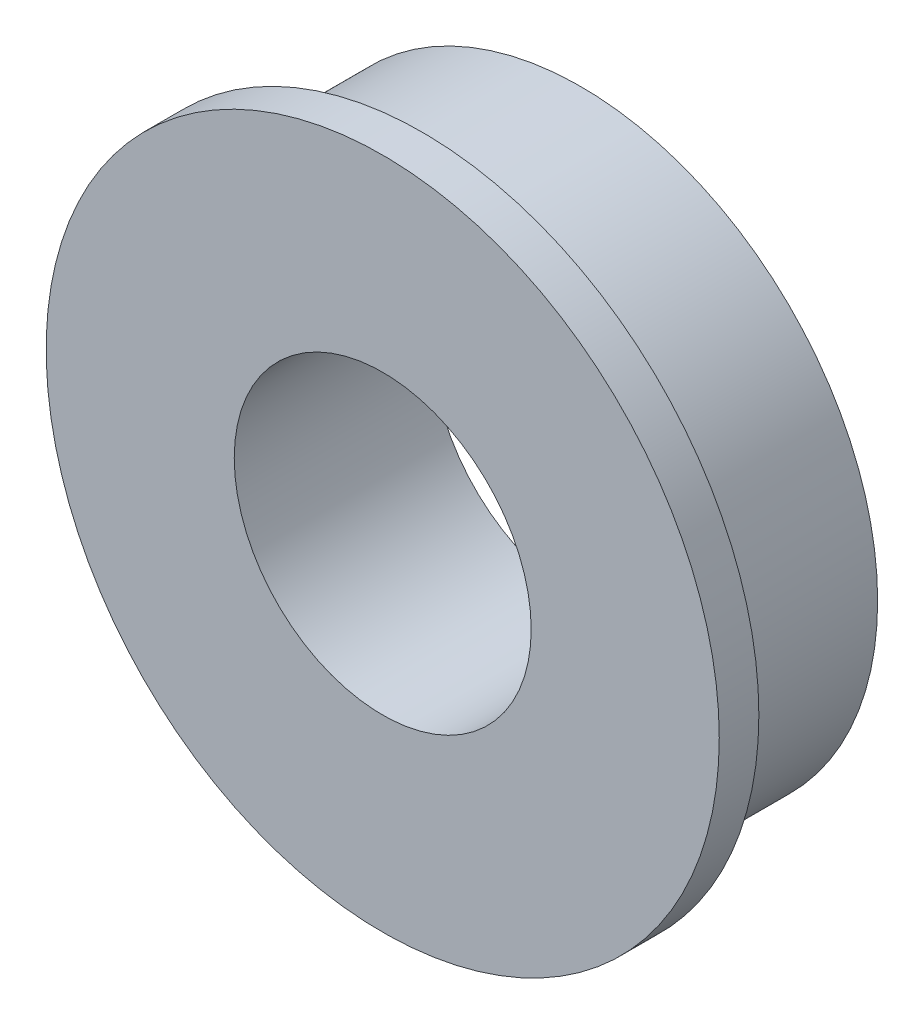
ISO-10303-21;
HEADER;
FILE_DESCRIPTION(('STEP AP214'),'2;1');
FILE_NAME('part.step','',(''),(''),'','','');
FILE_SCHEMA(('AUTOMOTIVE_DESIGN { 1 0 10303 214 1 1 1 1 }'));
ENDSEC;
DATA;
#1=APPLICATION_CONTEXT('core data for automotive mechanical design processes');
#2=APPLICATION_PROTOCOL_DEFINITION('international standard','automotive_design',2000,#1);
#3=PRODUCT_CONTEXT('',#1,'mechanical');
#4=PRODUCT('Part','Part','',(#3));
#5=PRODUCT_RELATED_PRODUCT_CATEGORY('part','',(#4));
#6=PRODUCT_DEFINITION_FORMATION('','',#4);
#7=PRODUCT_DEFINITION_CONTEXT('part definition',#1,'design');
#8=PRODUCT_DEFINITION('design','',#6,#7);
#9=PRODUCT_DEFINITION_SHAPE('','',#8);
#10=(LENGTH_UNIT() NAMED_UNIT(*) SI_UNIT(.MILLI.,.METRE.));
#11=(NAMED_UNIT(*) PLANE_ANGLE_UNIT() SI_UNIT($,.RADIAN.));
#12=(NAMED_UNIT(*) SI_UNIT($,.STERADIAN.) SOLID_ANGLE_UNIT());
#13=UNCERTAINTY_MEASURE_WITH_UNIT(LENGTH_MEASURE(1.E-05),#10,'distance_accuracy_value','');
#14=(GEOMETRIC_REPRESENTATION_CONTEXT(3) GLOBAL_UNCERTAINTY_ASSIGNED_CONTEXT((#13)) GLOBAL_UNIT_ASSIGNED_CONTEXT((#10,
#11,#12)) REPRESENTATION_CONTEXT('',''));
#15=CARTESIAN_POINT('',(0.,0.,0.));
#16=DIRECTION('',(0.,0.,1.));
#17=DIRECTION('',(1.,0.,0.));
#18=AXIS2_PLACEMENT_3D('',#15,#16,#17);
#19=CARTESIAN_POINT('',(0.,0.,0.));
#20=DIRECTION('',(0.,0.,1.));
#21=DIRECTION('',(1.,0.,0.));
#22=AXIS2_PLACEMENT_3D('',#19,#20,#21);
#23=PLANE('',#22);
#24=CARTESIAN_POINT('',(0.,0.,0.));
#25=DIRECTION('',(0.,0.,1.));
#26=DIRECTION('',(1.,0.,0.));
#27=AXIS2_PLACEMENT_3D('',#24,#25,#26);
#28=CIRCLE('',#27,6.);
#29=CARTESIAN_POINT('',(6.,0.,0.));
#30=VERTEX_POINT('',#29);
#31=EDGE_CURVE('E38',#30,#30,#28,.T.);
#32=ORIENTED_EDGE('',*,*,#31,.F.);
#33=EDGE_LOOP('',(#32));
#34=FACE_BOUND('',#33,.T.);
#35=CARTESIAN_POINT('',(0.,0.,0.));
#36=DIRECTION('',(0.,0.,1.));
#37=DIRECTION('',(1.,0.,0.));
#38=AXIS2_PLACEMENT_3D('',#35,#36,#37);
#39=CIRCLE('',#38,3.);
#40=CARTESIAN_POINT('',(3.,0.,0.));
#41=VERTEX_POINT('',#40);
#42=EDGE_CURVE('E49',#41,#41,#39,.T.);
#43=ORIENTED_EDGE('',*,*,#42,.T.);
#44=EDGE_LOOP('',(#43));
#45=FACE_BOUND('',#44,.T.);
#46=ADVANCED_FACE('F34',(#34,#45),#23,.F.);
#47=CARTESIAN_POINT('',(0.,0.,3.2));
#48=DIRECTION('',(0.,0.,-1.));
#49=DIRECTION('',(-1.,0.,0.));
#50=AXIS2_PLACEMENT_3D('',#47,#48,#49);
#51=CYLINDRICAL_SURFACE('',#50,6.);
#52=CARTESIAN_POINT('',(0.,0.,3.2));
#53=DIRECTION('',(0.,0.,1.));
#54=DIRECTION('',(1.,0.,0.));
#55=AXIS2_PLACEMENT_3D('',#52,#53,#54);
#56=CIRCLE('',#55,6.);
#57=CARTESIAN_POINT('',(6.,0.,3.2));
#58=VERTEX_POINT('',#57);
#59=EDGE_CURVE('E10',#58,#58,#56,.T.);
#60=ORIENTED_EDGE('',*,*,#59,.F.);
#61=EDGE_LOOP('',(#60));
#62=FACE_BOUND('',#61,.T.);
#63=ORIENTED_EDGE('',*,*,#31,.T.);
#64=EDGE_LOOP('',(#63));
#65=FACE_BOUND('',#64,.T.);
#66=ADVANCED_FACE('F36',(#62,#65),#51,.T.);
#67=CARTESIAN_POINT('',(0.,0.,3.2));
#68=DIRECTION('',(0.,0.,-1.));
#69=DIRECTION('',(-1.,0.,0.));
#70=AXIS2_PLACEMENT_3D('',#67,#68,#69);
#71=CYLINDRICAL_SURFACE('',#70,3.);
#72=ORIENTED_EDGE('',*,*,#42,.F.);
#73=EDGE_LOOP('',(#72));
#74=FACE_BOUND('',#73,.T.);
#75=CARTESIAN_POINT('',(0.,0.,4.));
#76=DIRECTION('',(0.,0.,1.));
#77=DIRECTION('',(1.,0.,0.));
#78=AXIS2_PLACEMENT_3D('',#75,#76,#77);
#79=CIRCLE('',#78,3.);
#80=CARTESIAN_POINT('',(3.,0.,4.));
#81=VERTEX_POINT('',#80);
#82=EDGE_CURVE('E57',#81,#81,#79,.F.);
#83=ORIENTED_EDGE('',*,*,#82,.F.);
#84=EDGE_LOOP('',(#83));
#85=FACE_BOUND('',#84,.T.);
#86=ADVANCED_FACE('F70',(#74,#85),#71,.F.);
#87=CARTESIAN_POINT('',(0.,0.,4.));
#88=DIRECTION('',(0.,0.,-1.));
#89=DIRECTION('',(-1.,0.,0.));
#90=AXIS2_PLACEMENT_3D('',#87,#88,#89);
#91=CYLINDRICAL_SURFACE('',#90,6.8);
#92=CARTESIAN_POINT('',(0.,0.,4.));
#93=DIRECTION('',(0.,0.,1.));
#94=DIRECTION('',(1.,0.,0.));
#95=AXIS2_PLACEMENT_3D('',#92,#93,#94);
#96=CIRCLE('',#95,6.8);
#97=CARTESIAN_POINT('',(6.8,0.,4.));
#98=VERTEX_POINT('',#97);
#99=EDGE_CURVE('E53',#98,#98,#96,.T.);
#100=ORIENTED_EDGE('',*,*,#99,.F.);
#101=EDGE_LOOP('',(#100));
#102=FACE_BOUND('',#101,.T.);
#103=CARTESIAN_POINT('',(0.,0.,3.2));
#104=DIRECTION('',(0.,0.,1.));
#105=DIRECTION('',(1.,0.,0.));
#106=AXIS2_PLACEMENT_3D('',#103,#104,#105);
#107=CIRCLE('',#106,6.8);
#108=CARTESIAN_POINT('',(6.8,0.,3.2));
#109=VERTEX_POINT('',#108);
#110=EDGE_CURVE('E54',#109,#109,#107,.T.);
#111=ORIENTED_EDGE('',*,*,#110,.T.);
#112=EDGE_LOOP('',(#111));
#113=FACE_BOUND('',#112,.T.);
#114=ADVANCED_FACE('F72',(#102,#113),#91,.T.);
#115=CARTESIAN_POINT('',(0.,0.,4.));
#116=DIRECTION('',(0.,0.,1.));
#117=DIRECTION('',(1.,0.,0.));
#118=AXIS2_PLACEMENT_3D('',#115,#116,#117);
#119=PLANE('',#118);
#120=ORIENTED_EDGE('',*,*,#82,.T.);
#121=EDGE_LOOP('',(#120));
#122=FACE_BOUND('',#121,.T.);
#123=ORIENTED_EDGE('',*,*,#99,.T.);
#124=EDGE_LOOP('',(#123));
#125=FACE_BOUND('',#124,.T.);
#126=ADVANCED_FACE('F67',(#122,#125),#119,.T.);
#127=CARTESIAN_POINT('',(0.,0.,3.2));
#128=DIRECTION('',(0.,0.,1.));
#129=DIRECTION('',(1.,0.,0.));
#130=AXIS2_PLACEMENT_3D('',#127,#128,#129);
#131=PLANE('',#130);
#132=ORIENTED_EDGE('',*,*,#59,.T.);
#133=EDGE_LOOP('',(#132));
#134=FACE_BOUND('',#133,.T.);
#135=ORIENTED_EDGE('',*,*,#110,.F.);
#136=EDGE_LOOP('',(#135));
#137=FACE_BOUND('',#136,.T.);
#138=ADVANCED_FACE('F108',(#134,#137),#131,.F.);
#139=CLOSED_SHELL('',(#46,#66,#86,#114,#126,#138));
#140=MANIFOLD_SOLID_BREP('B2',#139);
#141=ADVANCED_BREP_SHAPE_REPRESENTATION('',(#18,#140),#14);
#142=SHAPE_DEFINITION_REPRESENTATION(#9,#141);
ENDSEC;
END-ISO-10303-21;
